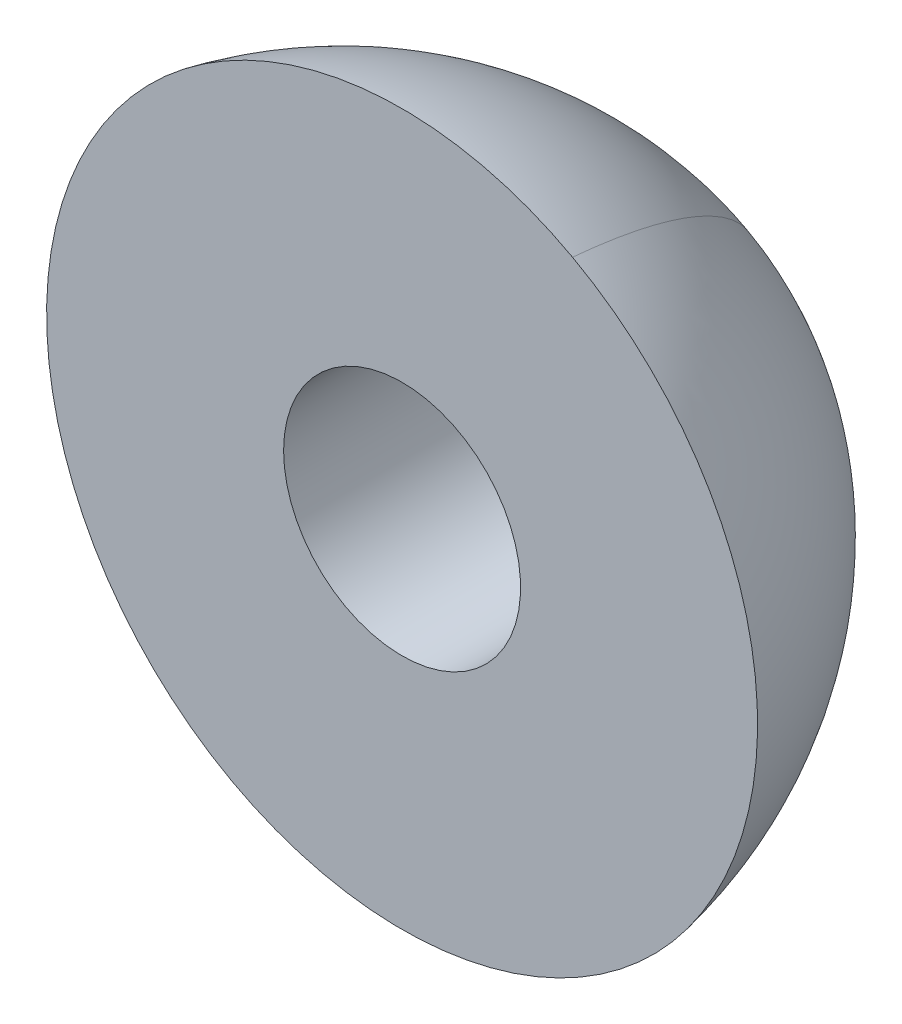
ISO-10303-21;
HEADER;
FILE_DESCRIPTION(('STEP AP214'),'2;1');
FILE_NAME('part.step','',(''),(''),'','','');
FILE_SCHEMA(('AUTOMOTIVE_DESIGN { 1 0 10303 214 1 1 1 1 }'));
ENDSEC;
DATA;
#1=APPLICATION_CONTEXT('core data for automotive mechanical design processes');
#2=APPLICATION_PROTOCOL_DEFINITION('international standard','automotive_design',2000,#1);
#3=PRODUCT_CONTEXT('',#1,'mechanical');
#4=PRODUCT('Part','Part','',(#3));
#5=PRODUCT_RELATED_PRODUCT_CATEGORY('part','',(#4));
#6=PRODUCT_DEFINITION_FORMATION('','',#4);
#7=PRODUCT_DEFINITION_CONTEXT('part definition',#1,'design');
#8=PRODUCT_DEFINITION('design','',#6,#7);
#9=PRODUCT_DEFINITION_SHAPE('','',#8);
#10=(LENGTH_UNIT() NAMED_UNIT(*) SI_UNIT(.MILLI.,.METRE.));
#11=(NAMED_UNIT(*) PLANE_ANGLE_UNIT() SI_UNIT($,.RADIAN.));
#12=(NAMED_UNIT(*) SI_UNIT($,.STERADIAN.) SOLID_ANGLE_UNIT());
#13=UNCERTAINTY_MEASURE_WITH_UNIT(LENGTH_MEASURE(1.E-05),#10,'distance_accuracy_value','');
#14=(GEOMETRIC_REPRESENTATION_CONTEXT(3) GLOBAL_UNCERTAINTY_ASSIGNED_CONTEXT((#13)) GLOBAL_UNIT_ASSIGNED_CONTEXT((#10,
#11,#12)) REPRESENTATION_CONTEXT('',''));
#15=CARTESIAN_POINT('',(0.,0.,0.));
#16=DIRECTION('',(0.,0.,1.));
#17=DIRECTION('',(1.,0.,0.));
#18=AXIS2_PLACEMENT_3D('',#15,#16,#17);
#19=CARTESIAN_POINT('',(6.412655328604,-3.67345046583847,-7.02));
#20=CARTESIAN_POINT('',(6.27820515603502,-3.6,-7.02));
#21=CARTESIAN_POINT('',(6.125,-3.6,-7.02));
#22=CARTESIAN_POINT('',(5.525,-3.6,-7.02));
#23=CARTESIAN_POINT('',(5.525,-4.2,-7.02));
#24=CARTESIAN_POINT('',(5.525,-4.8,-7.02));
#25=CARTESIAN_POINT('',(6.125,-4.8,-7.02));
#26=CARTESIAN_POINT('',(6.725,-4.8,-7.02));
#27=CARTESIAN_POINT('',(6.725,-4.2,-7.02));
#28=CARTESIAN_POINT('',(6.725,-3.84408514170272,-7.02));
#29=CARTESIAN_POINT('',(6.412655328604,-3.67345046583847,-7.02));
#30=CARTESIAN_POINT('',(6.39684211634302,-3.70239635601204,-7.18295627713));
#31=CARTESIAN_POINT('',(6.26978304314174,-3.63298366626,-7.18295627713));
#32=CARTESIAN_POINT('',(6.125,-3.63298366626,-7.18295627713));
#33=CARTESIAN_POINT('',(5.55798366626,-3.63298366626,-7.18295627713));
#34=CARTESIAN_POINT('',(5.55798366626,-4.2,-7.18295627713));
#35=CARTESIAN_POINT('',(5.55798366626,-4.76701633374,-7.18295627713));
#36=CARTESIAN_POINT('',(6.125,-4.76701633374,-7.18295627713));
#37=CARTESIAN_POINT('',(6.69201633374,-4.76701633374,-7.18295627713));
#38=CARTESIAN_POINT('',(6.69201633374,-4.2,-7.18295627713));
#39=CARTESIAN_POINT('',(6.69201633374,-3.86365076987447,-7.18295627713));
#40=CARTESIAN_POINT('',(6.39684211634302,-3.70239635601204,-7.18295627713));
#41=CARTESIAN_POINT('',(6.35618670725368,-3.77681558134337,-7.33577286233));
#42=CARTESIAN_POINT('',(6.24812998243388,-3.71778392208,-7.33577286233));
#43=CARTESIAN_POINT('',(6.125,-3.71778392208,-7.33577286233));
#44=CARTESIAN_POINT('',(5.64278392208,-3.71778392208,-7.33577286233));
#45=CARTESIAN_POINT('',(5.64278392208,-4.2,-7.33577286233));
#46=CARTESIAN_POINT('',(5.64278392208,-4.68221607792,-7.33577286233));
#47=CARTESIAN_POINT('',(6.125,-4.68221607792,-7.33577286233));
#48=CARTESIAN_POINT('',(6.60721607792,-4.68221607792,-7.33577286233));
#49=CARTESIAN_POINT('',(6.60721607792,-4.2,-7.33577286233));
#50=CARTESIAN_POINT('',(6.60721607792,-3.91395355493072,-7.33577286233));
#51=CARTESIAN_POINT('',(6.35618670725368,-3.77681558134337,-7.33577286233));
#52=CARTESIAN_POINT('',(6.29363382138873,-3.89131786806441,-7.45204992331));
#53=CARTESIAN_POINT('',(6.21481433107471,-3.8482585832,-7.45204992331));
#54=CARTESIAN_POINT('',(6.125,-3.8482585832,-7.45204992331));
#55=CARTESIAN_POINT('',(5.7732585832,-3.8482585832,-7.45204992331));
#56=CARTESIAN_POINT('',(5.7732585832,-4.2,-7.45204992331));
#57=CARTESIAN_POINT('',(5.7732585832,-4.5517414168,-7.45204992331));
#58=CARTESIAN_POINT('',(6.125,-4.5517414168,-7.45204992331));
#59=CARTESIAN_POINT('',(6.4767414168,-4.5517414168,-7.45204992331));
#60=CARTESIAN_POINT('',(6.4767414168,-4.2,-7.45204992331));
#61=CARTESIAN_POINT('',(6.4767414168,-3.99135000580391,-7.45204992331));
#62=CARTESIAN_POINT('',(6.29363382138873,-3.89131786806441,-7.45204992331));
#63=CARTESIAN_POINT('',(6.22088510953467,-4.02448348861282,-7.52));
#64=CARTESIAN_POINT('',(6.17606838534501,-4.,-7.52));
#65=CARTESIAN_POINT('',(6.125,-4.,-7.52));
#66=CARTESIAN_POINT('',(5.925,-4.,-7.52));
#67=CARTESIAN_POINT('',(5.925,-4.2,-7.52));
#68=CARTESIAN_POINT('',(5.925,-4.4,-7.52));
#69=CARTESIAN_POINT('',(6.125,-4.4,-7.52));
#70=CARTESIAN_POINT('',(6.325,-4.4,-7.52));
#71=CARTESIAN_POINT('',(6.325,-4.2,-7.52));
#72=CARTESIAN_POINT('',(6.325,-4.08136171390091,-7.52));
#73=CARTESIAN_POINT('',(6.22088510953467,-4.02448348861282,-7.52));
#74=(BOUNDED_SURFACE() B_SPLINE_SURFACE(4,2,((#19,#20,#21,#22,#23,#24,#25,#26,#27,#28,#29),(#30,
#31,#32,#33,#34,#35,#36,#37,#38,#39,#40),(#41,#42,#43,#44,#45,#46,#47,#48,#49,#50,#51),(#52,#53,
#54,#55,#56,#57,#58,#59,#60,#61,#62),(#63,#64,#65,#66,#67,#68,#69,#70,#71,#72,#73)),
.UNSPECIFIED.,.F.,.T.,.F.) B_SPLINE_SURFACE_WITH_KNOTS((5,5),(3,2,2,2,2,3),(3.59338935395,
4.25843275699),(5.77021321442228,6.28318530717959,7.85398163397448,9.42477796076938,
10.9955742875643,12.0533985216019),
.UNSPECIFIED.) GEOMETRIC_REPRESENTATION_ITEM() RATIONAL_B_SPLINE_SURFACE(((0.871173024928758,
0.904350395499252,1.,0.707106781186548,1.,0.707106781186548,1.,0.707106781186548,1.,
0.802756385687296,0.871173024928758),(0.871173024928758,0.904350395499252,1.,0.707106781186548,
1.,0.707106781186548,1.,0.707106781186548,1.,0.802756385687296,0.871173024928758),
(0.871173024928758,0.904350395499252,1.,0.707106781186548,1.,0.707106781186548,1.,
0.707106781186548,1.,0.802756385687296,0.871173024928758),(0.871173024928758,0.904350395499252,
1.,0.707106781186548,1.,0.707106781186548,1.,0.707106781186548,1.,0.802756385687296,
0.871173024928758),(0.871173024928758,0.904350395499252,1.,0.707106781186548,1.,
0.707106781186548,1.,0.707106781186548,1.,0.802756385687296,0.871173024928758))) REPRESENTATION_ITEM('') SURFACE());
#75=CARTESIAN_POINT('',(6.125,-4.20000000000001,-7.01999999999999));
#76=DIRECTION('',(0.,0.,1.));
#77=DIRECTION('',(0.,-1.,0.));
#78=AXIS2_PLACEMENT_3D('',#75,#76,#77);
#79=CIRCLE('',#78,0.600000000000013);
#80=CARTESIAN_POINT('',(6.41265532497554,-3.67345046385623,-7.02));
#81=VERTEX_POINT('',#80);
#82=CARTESIAN_POINT('',(5.83734467684184,-4.72654953713662,-7.01999999999999));
#83=VERTEX_POINT('',#82);
#84=EDGE_CURVE('E53',#81,#83,#79,.T.);
#85=CARTESIAN_POINT('',(6.412655328604,-3.67345046583847,-7.02));
#86=CARTESIAN_POINT('',(6.41265408956008,-3.67345273389318,-7.02001276843559));
#87=CARTESIAN_POINT('',(6.41265285034511,-3.67345500226091,-7.02002553679603));
#88=CARTESIAN_POINT('',(6.41265037157201,-3.67345953962452,-7.02005107337679));
#89=CARTESIAN_POINT('',(6.41264913201386,-3.6734618086204,-7.02006384159712));
#90=CARTESIAN_POINT('',(6.41143774241921,-3.67567924230986,-7.03254011214215));
#91=CARTESIAN_POINT('',(6.41006398913343,-3.67819388070325,-7.04493732125467));
#92=CARTESIAN_POINT('',(6.40703959665165,-3.6837299937602,-7.06919583485099));
#93=CARTESIAN_POINT('',(6.40539822154531,-3.68673451062118,-7.08106221333037));
#94=CARTESIAN_POINT('',(6.40187119588381,-3.69319068754273,-7.1042417063731));
#95=CARTESIAN_POINT('',(6.39999443746646,-3.69662607065463,-7.1155606982871));
#96=CARTESIAN_POINT('',(6.39602837963645,-3.70388589055799,-7.13763230850316));
#97=CARTESIAN_POINT('',(6.39394756654932,-3.70769479323494,-7.14839156728309));
#98=CARTESIAN_POINT('',(6.38960179097611,-3.71564968179954,-7.16934701003076));
#99=CARTESIAN_POINT('',(6.38734466448131,-3.7197813240016,-7.17955026559664));
#100=CARTESIAN_POINT('',(6.38267717327046,-3.72832510908689,-7.1993810910547));
#101=CARTESIAN_POINT('',(6.38027446166044,-3.7327232430537,-7.20901650055761));
#102=CARTESIAN_POINT('',(6.37534361470125,-3.74174909760147,-7.22771464321151));
#103=CARTESIAN_POINT('',(6.37282269404083,-3.74636361178343,-7.23678565628976));
#104=CARTESIAN_POINT('',(6.36768178875308,-3.7557739755231,-7.25436194271923));
#105=CARTESIAN_POINT('',(6.36506858196868,-3.76055741832268,-7.2628758436476));
#106=CARTESIAN_POINT('',(6.35976797371724,-3.77026011637888,-7.27934822269515));
#107=CARTESIAN_POINT('',(6.35708691924254,-3.77516775354409,-7.28731558908579));
#108=CARTESIAN_POINT('',(6.3516739777616,-3.78507607620149,-7.30270807472915));
#109=CARTESIAN_POINT('',(6.34894801629547,-3.7900659150654,-7.31014226238898));
#110=CARTESIAN_POINT('',(6.34346711338565,-3.8000986402891,-7.32448395087552));
#111=CARTESIAN_POINT('',(6.34071768805665,-3.80513142946878,-7.33140062574623));
#112=CARTESIAN_POINT('',(6.33521021338226,-3.81521279398759,-7.34472479501338));
#113=CARTESIAN_POINT('',(6.33245728462541,-3.82025199615236,-7.35114150053846));
#114=CARTESIAN_POINT('',(6.32696168082512,-3.83031163118919,-7.36348479216272));
#115=CARTESIAN_POINT('',(6.32422374633109,-3.83532338654384,-7.36942056312085));
#116=CARTESIAN_POINT('',(6.31877558179634,-3.8452961845957,-7.38082221057894));
#117=CARTESIAN_POINT('',(6.31606972791751,-3.85024921678237,-7.38629718863656));
#118=CARTESIAN_POINT('',(6.31070172953844,-3.86007527167943,-7.39679840007973));
#119=CARTESIAN_POINT('',(6.30804361583833,-3.86494091605971,-7.40183359527763));
#120=CARTESIAN_POINT('',(6.30278591969178,-3.87456506408392,-7.41147669249218));
#121=CARTESIAN_POINT('',(6.30019003182089,-3.87931680485271,-7.41609338000427));
#122=CARTESIAN_POINT('',(6.29271722391937,-3.89299568766168,-7.42897839926138));
#123=CARTESIAN_POINT('',(6.28776060970471,-3.90206870892664,-7.43704727764394));
#124=CARTESIAN_POINT('',(6.27821597617101,-3.91954004304773,-7.45170496451424));
#125=CARTESIAN_POINT('',(6.27365040489508,-3.92789726503665,-7.45835761338281));
#126=CARTESIAN_POINT('',(6.26496457283691,-3.94379657364688,-7.4703551689071));
#127=CARTESIAN_POINT('',(6.26086273602462,-3.95130493541727,-7.4757581269785));
#128=CARTESIAN_POINT('',(6.25316594163066,-3.96539382277428,-7.48541640813851));
#129=CARTESIAN_POINT('',(6.2495858164743,-3.9719471977882,-7.48972323230902));
#130=CARTESIAN_POINT('',(6.24298039250175,-3.9840383450397,-7.49733392164033));
#131=CARTESIAN_POINT('',(6.23996679463721,-3.98955469882808,-7.50068201661196));
#132=CARTESIAN_POINT('',(6.23453099649801,-3.99950486040269,-7.50650070968455));
#133=CARTESIAN_POINT('',(6.23211774404631,-4.00392228930807,-7.5090077415448));
#134=CARTESIAN_POINT('',(6.22677529626718,-4.01370157422412,-7.5143909796591));
#135=CARTESIAN_POINT('',(6.22383984074523,-4.01907488944831,-7.51724017859778));
#136=CARTESIAN_POINT('',(6.22088510953467,-4.02448348861282,-7.52));
#137=B_SPLINE_CURVE_WITH_KNOTS('',3,(#85,#86,#87,#88,#89,#90,#91,#92,#93,#94,#95,#96,#97,#98,
#99,#100,#101,#102,#103,#104,#105,#106,#107,#108,#109,#110,#111,#112,#113,#114,#115,#116,#117,
#118,#119,#120,#121,#122,#123,#124,#125,#126,#127,#128,#129,#130,#131,#132,#133,#134,#135,#136),
.UNSPECIFIED.,.F.,.F.,(4,2,2,2,2,2,2,2,2,2,2,2,2,2,2,2,2,2,2,2,2,2,2,2,2,4),(0.,
3.90820904271237E-05,7.81641949992448E-05,0.0382277688920655,0.0752625821916075,
0.111177001341982,0.145967826906764,0.17966598830534,0.212236748719884,0.243680717475125,
0.27399894264191,0.303192641498129,0.331263007798452,0.358211084788433,0.38403769228265,
0.40874339632082,0.43232851068211,0.454793120677699,0.47613712099255,0.515458320597044,
0.550294234916073,0.580641392074095,0.606497001869324,0.627859396609758,0.644728045121019,
0.664985304137382),.UNSPECIFIED.);
#138=CARTESIAN_POINT('',(6.2208851081732,-4.02448348786905,-7.52));
#139=VERTEX_POINT('',#138);
#140=EDGE_CURVE('E42',#81,#139,#137,.T.);
#141=CARTESIAN_POINT('',(6.125,-4.20000000000001,-7.52));
#142=DIRECTION('',(0.,0.,-1.));
#143=DIRECTION('',(-1.,0.,0.));
#144=AXIS2_PLACEMENT_3D('',#141,#142,#143);
#145=CIRCLE('',#144,0.199999999999998);
#146=CARTESIAN_POINT('',(6.02911489227989,-4.37551651237848,-7.52));
#147=VERTEX_POINT('',#146);
#148=EDGE_CURVE('E51',#147,#139,#145,.T.);
#149=CARTESIAN_POINT('',(5.83734467684185,-4.72654953713661,-7.02));
#150=CARTESIAN_POINT('',(5.85315788880345,-4.69760364679949,-7.18295627713));
#151=CARTESIAN_POINT('',(5.89381329712311,-4.62318442104768,-7.33577286233));
#152=CARTESIAN_POINT('',(5.95636618180382,-4.50868213367969,-7.45204992331));
#153=CARTESIAN_POINT('',(6.02911489228062,-4.37551651237887,-7.52));
#154=B_SPLINE_CURVE_WITH_KNOTS('',4,(#149,#150,#151,#152,#153),.UNSPECIFIED.,.F.,.F.,(5,5),
(3.59338935395,4.25843275699),.UNSPECIFIED.);
#155=EDGE_CURVE('E35',#147,#83,#154,.F.);
#156=ORIENTED_EDGE('',*,*,#84,.F.);
#157=ORIENTED_EDGE('',*,*,#140,.T.);
#158=ORIENTED_EDGE('',*,*,#148,.F.);
#159=ORIENTED_EDGE('',*,*,#155,.T.);
#160=EDGE_LOOP('',(#156,#157,#158,#159));
#161=FACE_BOUND('',#160,.T.);
#162=ADVANCED_FACE('F17',(#161),#74,.T.);
#163=CARTESIAN_POINT('',(6.125,-4.20000000000001,-7.02));
#164=DIRECTION('',(0.,0.,-1.));
#165=DIRECTION('',(-1.,0.,0.));
#166=AXIS2_PLACEMENT_3D('',#163,#164,#165);
#167=CYLINDRICAL_SURFACE('',#166,0.199999999999998);
#168=CARTESIAN_POINT('',(6.125,-4.2,-7.52));
#169=DIRECTION('',(0.,0.,1.));
#170=DIRECTION('',(1.,0.,0.));
#171=AXIS2_PLACEMENT_3D('',#168,#169,#170);
#172=CIRCLE('',#171,0.2);
#173=EDGE_CURVE('E27',#147,#139,#172,.T.);
#174=ORIENTED_EDGE('',*,*,#173,.F.);
#175=ORIENTED_EDGE('',*,*,#148,.T.);
#176=EDGE_LOOP('',(#174,#175));
#177=FACE_BOUND('',#176,.T.);
#178=CARTESIAN_POINT('',(6.125,-4.20000000000001,-7.02));
#179=DIRECTION('',(0.,0.,-1.));
#180=DIRECTION('',(-1.,0.,0.));
#181=AXIS2_PLACEMENT_3D('',#178,#179,#180);
#182=CIRCLE('',#181,0.199999999999998);
#183=CARTESIAN_POINT('',(5.925,-4.20000000000001,-7.02));
#184=VERTEX_POINT('',#183);
#185=EDGE_CURVE('E57',#184,#184,#182,.T.);
#186=ORIENTED_EDGE('',*,*,#185,.F.);
#187=EDGE_LOOP('',(#186));
#188=FACE_BOUND('',#187,.T.);
#189=ADVANCED_FACE('F55',(#177,#188),#167,.F.);
#190=CARTESIAN_POINT('',(6.94020486029457,-3.38479513970218,-7.02));
#191=DIRECTION('',(0.,0.,1.));
#192=DIRECTION('',(-1.,0.,0.));
#193=AXIS2_PLACEMENT_3D('',#190,#191,#192);
#194=PLANE('',#193);
#195=ORIENTED_EDGE('',*,*,#185,.T.);
#196=EDGE_LOOP('',(#195));
#197=FACE_BOUND('',#196,.T.);
#198=CARTESIAN_POINT('',(6.125,-4.2,-7.02));
#199=DIRECTION('',(0.,0.,1.));
#200=DIRECTION('',(1.,0.,0.));
#201=AXIS2_PLACEMENT_3D('',#198,#199,#200);
#202=CIRCLE('',#201,0.6);
#203=EDGE_CURVE('E11',#81,#83,#202,.F.);
#204=ORIENTED_EDGE('',*,*,#203,.F.);
#205=ORIENTED_EDGE('',*,*,#84,.T.);
#206=EDGE_LOOP('',(#204,#205));
#207=FACE_BOUND('',#206,.T.);
#208=ADVANCED_FACE('F19',(#197,#207),#194,.T.);
#209=CARTESIAN_POINT('',(6.125,-3.6,-7.02));
#210=CARTESIAN_POINT('',(5.525,-3.6,-7.02));
#211=CARTESIAN_POINT('',(5.525,-4.2,-7.02));
#212=CARTESIAN_POINT('',(5.525,-4.8,-7.02));
#213=CARTESIAN_POINT('',(6.125,-4.8,-7.02));
#214=CARTESIAN_POINT('',(6.725,-4.8,-7.02));
#215=CARTESIAN_POINT('',(6.725,-4.2,-7.02));
#216=CARTESIAN_POINT('',(6.725,-3.6,-7.02));
#217=CARTESIAN_POINT('',(6.125,-3.6,-7.02));
#218=CARTESIAN_POINT('',(6.125,-3.63298366626,-7.18295627713));
#219=CARTESIAN_POINT('',(5.55798366626,-3.63298366626,-7.18295627713));
#220=CARTESIAN_POINT('',(5.55798366626,-4.2,-7.18295627713));
#221=CARTESIAN_POINT('',(5.55798366626,-4.76701633374,-7.18295627713));
#222=CARTESIAN_POINT('',(6.125,-4.76701633374,-7.18295627713));
#223=CARTESIAN_POINT('',(6.69201633374,-4.76701633374,-7.18295627713));
#224=CARTESIAN_POINT('',(6.69201633374,-4.2,-7.18295627713));
#225=CARTESIAN_POINT('',(6.69201633374,-3.63298366626,-7.18295627713));
#226=CARTESIAN_POINT('',(6.125,-3.63298366626,-7.18295627713));
#227=CARTESIAN_POINT('',(6.125,-3.71778392208,-7.33577286233));
#228=CARTESIAN_POINT('',(5.64278392208,-3.71778392208,-7.33577286233));
#229=CARTESIAN_POINT('',(5.64278392208,-4.2,-7.33577286233));
#230=CARTESIAN_POINT('',(5.64278392208,-4.68221607792,-7.33577286233));
#231=CARTESIAN_POINT('',(6.125,-4.68221607792,-7.33577286233));
#232=CARTESIAN_POINT('',(6.60721607792,-4.68221607792,-7.33577286233));
#233=CARTESIAN_POINT('',(6.60721607792,-4.2,-7.33577286233));
#234=CARTESIAN_POINT('',(6.60721607792,-3.71778392208,-7.33577286233));
#235=CARTESIAN_POINT('',(6.125,-3.71778392208,-7.33577286233));
#236=CARTESIAN_POINT('',(6.125,-3.8482585832,-7.45204992331));
#237=CARTESIAN_POINT('',(5.7732585832,-3.8482585832,-7.45204992331));
#238=CARTESIAN_POINT('',(5.7732585832,-4.2,-7.45204992331));
#239=CARTESIAN_POINT('',(5.7732585832,-4.5517414168,-7.45204992331));
#240=CARTESIAN_POINT('',(6.125,-4.5517414168,-7.45204992331));
#241=CARTESIAN_POINT('',(6.4767414168,-4.5517414168,-7.45204992331));
#242=CARTESIAN_POINT('',(6.4767414168,-4.2,-7.45204992331));
#243=CARTESIAN_POINT('',(6.4767414168,-3.8482585832,-7.45204992331));
#244=CARTESIAN_POINT('',(6.125,-3.8482585832,-7.45204992331));
#245=CARTESIAN_POINT('',(6.125,-4.,-7.52));
#246=CARTESIAN_POINT('',(5.925,-4.,-7.52));
#247=CARTESIAN_POINT('',(5.925,-4.2,-7.52));
#248=CARTESIAN_POINT('',(5.925,-4.4,-7.52));
#249=CARTESIAN_POINT('',(6.125,-4.4,-7.52));
#250=CARTESIAN_POINT('',(6.325,-4.4,-7.52));
#251=CARTESIAN_POINT('',(6.325,-4.2,-7.52));
#252=CARTESIAN_POINT('',(6.325,-4.,-7.52));
#253=CARTESIAN_POINT('',(6.125,-4.,-7.52));
#254=(BOUNDED_SURFACE() B_SPLINE_SURFACE(4,2,((#209,#210,#211,#212,#213,#214,#215,#216,#217),
(#218,#219,#220,#221,#222,#223,#224,#225,#226),(#227,#228,#229,#230,#231,#232,#233,#234,#235),
(#236,#237,#238,#239,#240,#241,#242,#243,#244),(#245,#246,#247,#248,#249,#250,#251,#252,#253)),
.UNSPECIFIED.,.F.,.T.,.F.) B_SPLINE_SURFACE_WITH_KNOTS((5,5),(3,2,2,2,3),(3.59338935395,
4.25843275699),(0.,1.5707963267949,3.14159265358979,4.71238898038469,6.28318530717959),
.UNSPECIFIED.) GEOMETRIC_REPRESENTATION_ITEM() RATIONAL_B_SPLINE_SURFACE(((1.,0.707106781186548,
1.,0.707106781186548,1.,0.707106781186548,1.,0.707106781186548,1.),(1.,0.707106781186548,1.,
0.707106781186548,1.,0.707106781186548,1.,0.707106781186548,1.),(1.,0.707106781186548,1.,
0.707106781186548,1.,0.707106781186548,1.,0.707106781186548,1.),(1.,0.707106781186548,1.,
0.707106781186548,1.,0.707106781186548,1.,0.707106781186548,1.),(1.,0.707106781186548,1.,
0.707106781186548,1.,0.707106781186548,1.,0.707106781186548,1.))) REPRESENTATION_ITEM('') SURFACE());
#255=ORIENTED_EDGE('',*,*,#203,.T.);
#256=ORIENTED_EDGE('',*,*,#155,.F.);
#257=ORIENTED_EDGE('',*,*,#173,.T.);
#258=ORIENTED_EDGE('',*,*,#140,.F.);
#259=EDGE_LOOP('',(#255,#256,#257,#258));
#260=FACE_BOUND('',#259,.T.);
#261=ADVANCED_FACE('F47',(#260),#254,.T.);
#262=CLOSED_SHELL('',(#162,#189,#208,#261));
#263=MANIFOLD_SOLID_BREP('B1',#262);
#264=ADVANCED_BREP_SHAPE_REPRESENTATION('',(#18,#263),#14);
#265=SHAPE_DEFINITION_REPRESENTATION(#9,#264);
ENDSEC;
END-ISO-10303-21;
